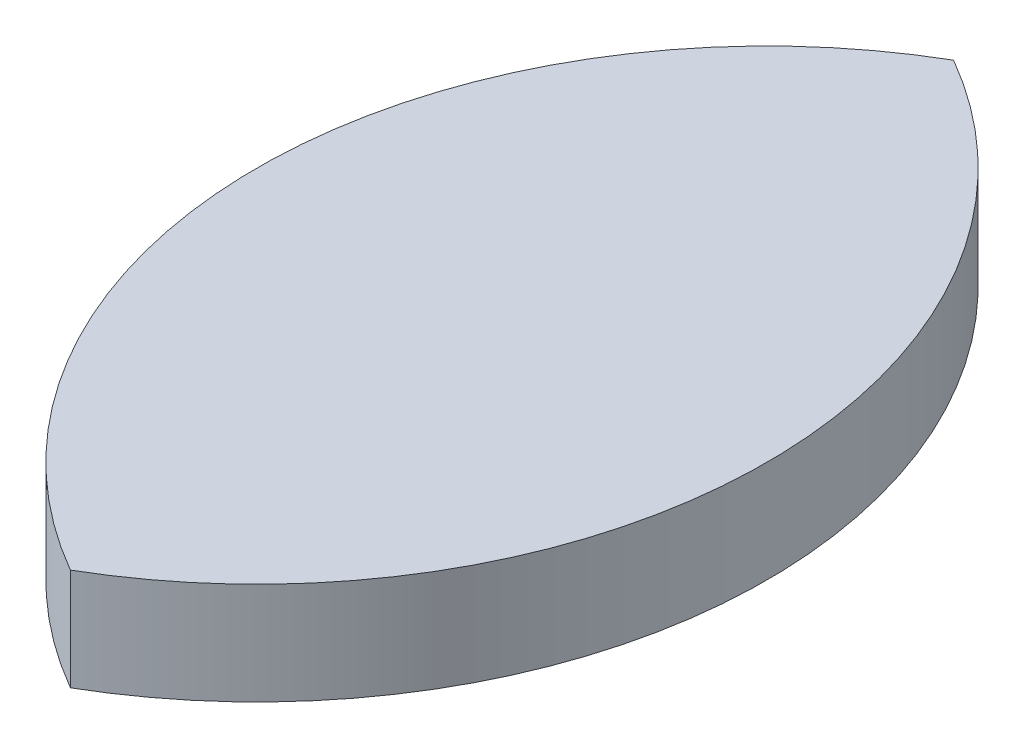
ISO-10303-21;
HEADER;
FILE_DESCRIPTION(('STEP AP214'),'2;1');
FILE_NAME('part.step','',(''),(''),'','','');
FILE_SCHEMA(('AUTOMOTIVE_DESIGN { 1 0 10303 214 1 1 1 1 }'));
ENDSEC;
DATA;
#1=APPLICATION_CONTEXT('core data for automotive mechanical design processes');
#2=APPLICATION_PROTOCOL_DEFINITION('international standard','automotive_design',2000,#1);
#3=PRODUCT_CONTEXT('',#1,'mechanical');
#4=PRODUCT('Part','Part','',(#3));
#5=PRODUCT_RELATED_PRODUCT_CATEGORY('part','',(#4));
#6=PRODUCT_DEFINITION_FORMATION('','',#4);
#7=PRODUCT_DEFINITION_CONTEXT('part definition',#1,'design');
#8=PRODUCT_DEFINITION('design','',#6,#7);
#9=PRODUCT_DEFINITION_SHAPE('','',#8);
#10=(LENGTH_UNIT() NAMED_UNIT(*) SI_UNIT(.MILLI.,.METRE.));
#11=(NAMED_UNIT(*) PLANE_ANGLE_UNIT() SI_UNIT($,.RADIAN.));
#12=(NAMED_UNIT(*) SI_UNIT($,.STERADIAN.) SOLID_ANGLE_UNIT());
#13=UNCERTAINTY_MEASURE_WITH_UNIT(LENGTH_MEASURE(1.E-05),#10,'distance_accuracy_value','');
#14=(GEOMETRIC_REPRESENTATION_CONTEXT(3) GLOBAL_UNCERTAINTY_ASSIGNED_CONTEXT((#13)) GLOBAL_UNIT_ASSIGNED_CONTEXT((#10,
#11,#12)) REPRESENTATION_CONTEXT('',''));
#15=CARTESIAN_POINT('',(0.,0.,0.));
#16=DIRECTION('',(0.,0.,1.));
#17=DIRECTION('',(1.,0.,0.));
#18=AXIS2_PLACEMENT_3D('',#15,#16,#17);
#19=CARTESIAN_POINT('',(50.,10.,0.));
#20=DIRECTION('',(0.,-1.,0.));
#21=DIRECTION('',(0.,0.,-1.));
#22=AXIS2_PLACEMENT_3D('',#19,#20,#21);
#23=CYLINDRICAL_SURFACE('',#22,50.);
#24=CARTESIAN_POINT('',(50.,0.,0.));
#25=DIRECTION('',(0.,1.,0.));
#26=DIRECTION('',(0.,0.,1.));
#27=AXIS2_PLACEMENT_3D('',#24,#25,#26);
#28=CIRCLE('',#27,50.);
#29=CARTESIAN_POINT('',(25.,0.,-43.3012701892219));
#30=VERTEX_POINT('',#29);
#31=CARTESIAN_POINT('',(25.,0.,43.3012701892219));
#32=VERTEX_POINT('',#31);
#33=EDGE_CURVE('E64',#30,#32,#28,.T.);
#34=ORIENTED_EDGE('',*,*,#33,.T.);
#35=DIRECTION('',(0.,-1.,0.));
#36=VECTOR('',#35,1.);
#37=CARTESIAN_POINT('',(25.,10.,43.3012701892219));
#38=LINE('',#37,#36);
#39=CARTESIAN_POINT('',(25.,10.,43.3012701892219));
#40=VERTEX_POINT('',#39);
#41=EDGE_CURVE('E11',#40,#32,#38,.T.);
#42=ORIENTED_EDGE('',*,*,#41,.F.);
#43=CARTESIAN_POINT('',(50.,10.,0.));
#44=DIRECTION('',(0.,1.,0.));
#45=DIRECTION('',(0.,0.,1.));
#46=AXIS2_PLACEMENT_3D('',#43,#44,#45);
#47=CIRCLE('',#46,50.);
#48=CARTESIAN_POINT('',(25.,10.,-43.3012701892219));
#49=VERTEX_POINT('',#48);
#50=EDGE_CURVE('E63',#49,#40,#47,.T.);
#51=ORIENTED_EDGE('',*,*,#50,.F.);
#52=DIRECTION('',(0.,-1.,0.));
#53=VECTOR('',#52,1.);
#54=CARTESIAN_POINT('',(25.,10.,-43.3012701892219));
#55=LINE('',#54,#53);
#56=EDGE_CURVE('E41',#49,#30,#55,.T.);
#57=ORIENTED_EDGE('',*,*,#56,.T.);
#58=EDGE_LOOP('',(#34,#42,#51,#57));
#59=FACE_BOUND('',#58,.T.);
#60=ADVANCED_FACE('F33',(#59),#23,.T.);
#61=CARTESIAN_POINT('',(0.,10.,0.));
#62=DIRECTION('',(0.,-1.,0.));
#63=DIRECTION('',(0.,0.,-1.));
#64=AXIS2_PLACEMENT_3D('',#61,#62,#63);
#65=CYLINDRICAL_SURFACE('',#64,50.);
#66=CARTESIAN_POINT('',(0.,0.,0.));
#67=DIRECTION('',(0.,1.,0.));
#68=DIRECTION('',(0.,0.,1.));
#69=AXIS2_PLACEMENT_3D('',#66,#67,#68);
#70=CIRCLE('',#69,50.);
#71=EDGE_CURVE('E56',#32,#30,#70,.T.);
#72=ORIENTED_EDGE('',*,*,#71,.T.);
#73=ORIENTED_EDGE('',*,*,#56,.F.);
#74=CARTESIAN_POINT('',(0.,10.,0.));
#75=DIRECTION('',(0.,1.,0.));
#76=DIRECTION('',(0.,0.,1.));
#77=AXIS2_PLACEMENT_3D('',#74,#75,#76);
#78=CIRCLE('',#77,50.);
#79=EDGE_CURVE('E48',#40,#49,#78,.T.);
#80=ORIENTED_EDGE('',*,*,#79,.F.);
#81=ORIENTED_EDGE('',*,*,#41,.T.);
#82=EDGE_LOOP('',(#72,#73,#80,#81));
#83=FACE_BOUND('',#82,.T.);
#84=ADVANCED_FACE('F59',(#83),#65,.T.);
#85=CARTESIAN_POINT('',(25.,10.,0.));
#86=DIRECTION('',(0.,1.,0.));
#87=DIRECTION('',(0.,0.,1.));
#88=AXIS2_PLACEMENT_3D('',#85,#86,#87);
#89=PLANE('',#88);
#90=ORIENTED_EDGE('',*,*,#50,.T.);
#91=ORIENTED_EDGE('',*,*,#79,.T.);
#92=EDGE_LOOP('',(#90,#91));
#93=FACE_BOUND('',#92,.T.);
#94=ADVANCED_FACE('F71',(#93),#89,.T.);
#95=CARTESIAN_POINT('',(25.,0.,0.));
#96=DIRECTION('',(0.,1.,0.));
#97=DIRECTION('',(0.,0.,1.));
#98=AXIS2_PLACEMENT_3D('',#95,#96,#97);
#99=PLANE('',#98);
#100=ORIENTED_EDGE('',*,*,#33,.F.);
#101=ORIENTED_EDGE('',*,*,#71,.F.);
#102=EDGE_LOOP('',(#100,#101));
#103=FACE_BOUND('',#102,.T.);
#104=ADVANCED_FACE('F67',(#103),#99,.F.);
#105=CLOSED_SHELL('',(#60,#84,#94,#104));
#106=MANIFOLD_SOLID_BREP('B2',#105);
#107=ADVANCED_BREP_SHAPE_REPRESENTATION('',(#18,#106),#14);
#108=SHAPE_DEFINITION_REPRESENTATION(#9,#107);
ENDSEC;
END-ISO-10303-21;
